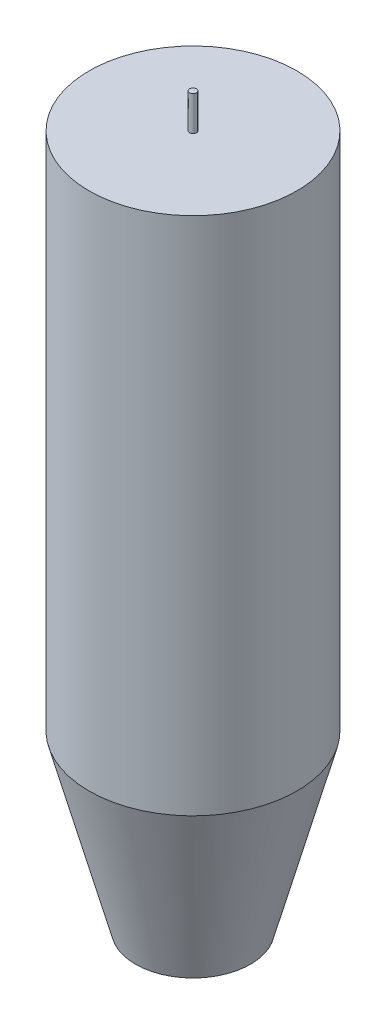
ISO-10303-21;
HEADER;
FILE_DESCRIPTION(('STEP AP214'),'2;1');
FILE_NAME('part.step','',(''),(''),'','','');
FILE_SCHEMA(('AUTOMOTIVE_DESIGN { 1 0 10303 214 1 1 1 1 }'));
ENDSEC;
DATA;
#1=APPLICATION_CONTEXT('core data for automotive mechanical design processes');
#2=APPLICATION_PROTOCOL_DEFINITION('international standard','automotive_design',2000,#1);
#3=PRODUCT_CONTEXT('',#1,'mechanical');
#4=PRODUCT('Part','Part','',(#3));
#5=PRODUCT_RELATED_PRODUCT_CATEGORY('part','',(#4));
#6=PRODUCT_DEFINITION_FORMATION('','',#4);
#7=PRODUCT_DEFINITION_CONTEXT('part definition',#1,'design');
#8=PRODUCT_DEFINITION('design','',#6,#7);
#9=PRODUCT_DEFINITION_SHAPE('','',#8);
#10=(LENGTH_UNIT() NAMED_UNIT(*) SI_UNIT(.MILLI.,.METRE.));
#11=(NAMED_UNIT(*) PLANE_ANGLE_UNIT() SI_UNIT($,.RADIAN.));
#12=(NAMED_UNIT(*) SI_UNIT($,.STERADIAN.) SOLID_ANGLE_UNIT());
#13=UNCERTAINTY_MEASURE_WITH_UNIT(LENGTH_MEASURE(1.E-05),#10,'distance_accuracy_value','');
#14=(GEOMETRIC_REPRESENTATION_CONTEXT(3) GLOBAL_UNCERTAINTY_ASSIGNED_CONTEXT((#13)) GLOBAL_UNIT_ASSIGNED_CONTEXT((#10,
#11,#12)) REPRESENTATION_CONTEXT('',''));
#15=CARTESIAN_POINT('',(0.,0.,0.));
#16=DIRECTION('',(0.,0.,1.));
#17=DIRECTION('',(1.,0.,0.));
#18=AXIS2_PLACEMENT_3D('',#15,#16,#17);
#19=CARTESIAN_POINT('',(0.,100.,0.));
#20=DIRECTION('',(0.,-1.,0.));
#21=DIRECTION('',(0.,0.,-1.));
#22=AXIS2_PLACEMENT_3D('',#19,#20,#21);
#23=CYLINDRICAL_SURFACE('',#22,15.);
#24=CARTESIAN_POINT('',(0.,25.0000000000004,0.));
#25=DIRECTION('',(0.,1.,0.));
#26=DIRECTION('',(0.,0.,1.));
#27=AXIS2_PLACEMENT_3D('',#24,#25,#26);
#28=CIRCLE('',#27,15.);
#29=CARTESIAN_POINT('',(0.,25.0000000000004,15.));
#30=VERTEX_POINT('',#29);
#31=EDGE_CURVE('E38',#30,#30,#28,.T.);
#32=ORIENTED_EDGE('',*,*,#31,.T.);
#33=EDGE_LOOP('',(#32));
#34=FACE_BOUND('',#33,.T.);
#35=CARTESIAN_POINT('',(0.,100.,0.));
#36=DIRECTION('',(0.,1.,0.));
#37=DIRECTION('',(0.,0.,1.));
#38=AXIS2_PLACEMENT_3D('',#35,#36,#37);
#39=CIRCLE('',#38,15.);
#40=CARTESIAN_POINT('',(0.,100.,15.));
#41=VERTEX_POINT('',#40);
#42=EDGE_CURVE('E42',#41,#41,#39,.T.);
#43=ORIENTED_EDGE('',*,*,#42,.F.);
#44=EDGE_LOOP('',(#43));
#45=FACE_BOUND('',#44,.T.);
#46=ADVANCED_FACE('F31',(#34,#45),#23,.T.);
#47=CARTESIAN_POINT('',(0.,100.,0.));
#48=DIRECTION('',(0.,1.,0.));
#49=DIRECTION('',(0.,0.,1.));
#50=AXIS2_PLACEMENT_3D('',#47,#48,#49);
#51=PLANE('',#50);
#52=CARTESIAN_POINT('',(0.,100.,0.));
#53=DIRECTION('',(0.,1.,0.));
#54=DIRECTION('',(0.,0.,1.));
#55=AXIS2_PLACEMENT_3D('',#52,#53,#54);
#56=CIRCLE('',#55,0.5);
#57=CARTESIAN_POINT('',(0.,100.,0.5));
#58=VERTEX_POINT('',#57);
#59=EDGE_CURVE('E49',#58,#58,#56,.T.);
#60=ORIENTED_EDGE('',*,*,#59,.F.);
#61=EDGE_LOOP('',(#60));
#62=FACE_BOUND('',#61,.T.);
#63=ORIENTED_EDGE('',*,*,#42,.T.);
#64=EDGE_LOOP('',(#63));
#65=FACE_BOUND('',#64,.T.);
#66=ADVANCED_FACE('F63',(#62,#65),#51,.T.);
#67=CARTESIAN_POINT('',(0.,0.,0.));
#68=DIRECTION('',(0.,1.,0.));
#69=DIRECTION('',(0.,0.,1.));
#70=AXIS2_PLACEMENT_3D('',#67,#68,#69);
#71=PLANE('',#70);
#72=CARTESIAN_POINT('',(0.,0.,0.));
#73=DIRECTION('',(0.,1.,0.));
#74=DIRECTION('',(0.,0.,1.));
#75=AXIS2_PLACEMENT_3D('',#72,#73,#74);
#76=CIRCLE('',#75,8.30127018922191);
#77=CARTESIAN_POINT('',(0.,0.,8.30127018922191));
#78=VERTEX_POINT('',#77);
#79=EDGE_CURVE('E10',#78,#78,#76,.F.);
#80=ORIENTED_EDGE('',*,*,#79,.T.);
#81=EDGE_LOOP('',(#80));
#82=FACE_BOUND('',#81,.T.);
#83=ADVANCED_FACE('F66',(#82),#71,.F.);
#84=CARTESIAN_POINT('',(0.,25.0000000000004,0.));
#85=DIRECTION('',(0.,1.,0.));
#86=DIRECTION('',(0.,0.,1.));
#87=AXIS2_PLACEMENT_3D('',#84,#85,#86);
#88=CONICAL_SURFACE('',#87,15.,0.261799387799147);
#89=ORIENTED_EDGE('',*,*,#79,.F.);
#90=EDGE_LOOP('',(#89));
#91=FACE_BOUND('',#90,.T.);
#92=ORIENTED_EDGE('',*,*,#31,.F.);
#93=EDGE_LOOP('',(#92));
#94=FACE_BOUND('',#93,.T.);
#95=ADVANCED_FACE('F33',(#91,#94),#88,.T.);
#96=CARTESIAN_POINT('',(0.,105.,0.));
#97=DIRECTION('',(0.,-1.,0.));
#98=DIRECTION('',(0.,0.,-1.));
#99=AXIS2_PLACEMENT_3D('',#96,#97,#98);
#100=CYLINDRICAL_SURFACE('',#99,0.5);
#101=CARTESIAN_POINT('',(0.,105.,0.));
#102=DIRECTION('',(0.,1.,0.));
#103=DIRECTION('',(0.,0.,1.));
#104=AXIS2_PLACEMENT_3D('',#101,#102,#103);
#105=CIRCLE('',#104,0.5);
#106=CARTESIAN_POINT('',(0.,105.,0.5));
#107=VERTEX_POINT('',#106);
#108=EDGE_CURVE('E46',#107,#107,#105,.T.);
#109=ORIENTED_EDGE('',*,*,#108,.F.);
#110=EDGE_LOOP('',(#109));
#111=FACE_BOUND('',#110,.T.);
#112=ORIENTED_EDGE('',*,*,#59,.T.);
#113=EDGE_LOOP('',(#112));
#114=FACE_BOUND('',#113,.T.);
#115=ADVANCED_FACE('F57',(#111,#114),#100,.T.);
#116=CARTESIAN_POINT('',(0.,105.,0.));
#117=DIRECTION('',(0.,1.,0.));
#118=DIRECTION('',(0.,0.,1.));
#119=AXIS2_PLACEMENT_3D('',#116,#117,#118);
#120=PLANE('',#119);
#121=ORIENTED_EDGE('',*,*,#108,.T.);
#122=EDGE_LOOP('',(#121));
#123=FACE_BOUND('',#122,.T.);
#124=ADVANCED_FACE('F55',(#123),#120,.T.);
#125=CLOSED_SHELL('',(#46,#66,#83,#95,#115,#124));
#126=MANIFOLD_SOLID_BREP('B2',#125);
#127=ADVANCED_BREP_SHAPE_REPRESENTATION('',(#18,#126),#14);
#128=SHAPE_DEFINITION_REPRESENTATION(#9,#127);
ENDSEC;
END-ISO-10303-21;
